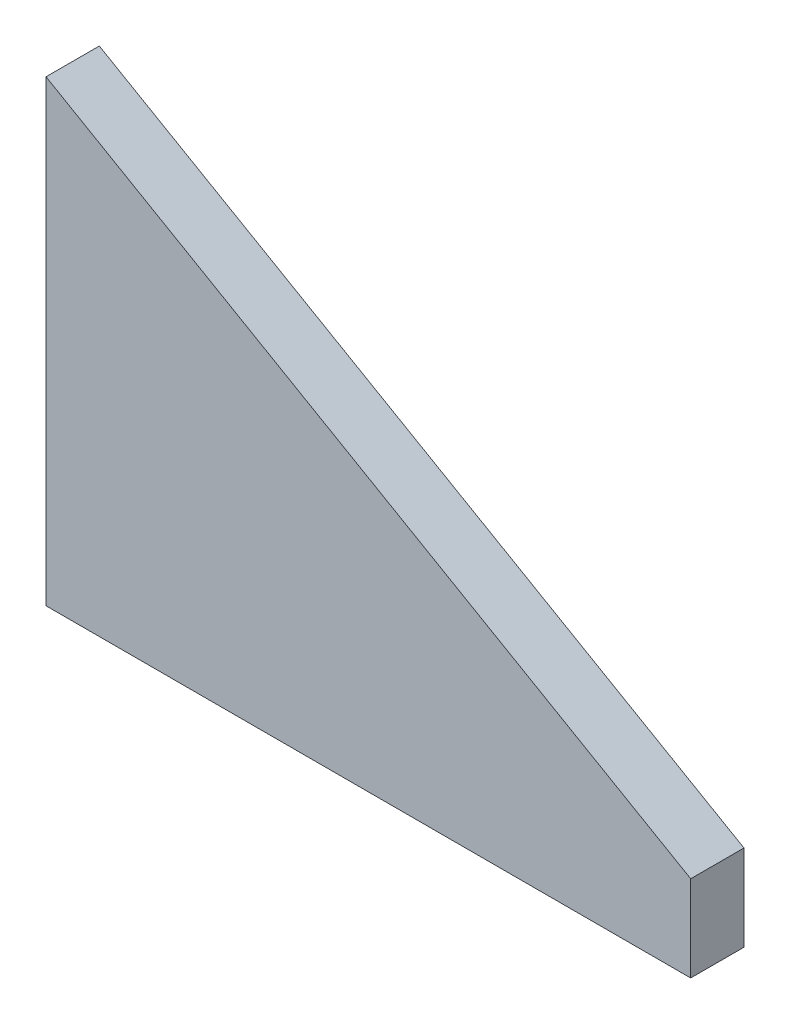
ISO-10303-21;
HEADER;
FILE_DESCRIPTION(('STEP AP214'),'2;1');
FILE_NAME('part.step','',(''),(''),'','','');
FILE_SCHEMA(('AUTOMOTIVE_DESIGN { 1 0 10303 214 1 1 1 1 }'));
ENDSEC;
DATA;
#1=APPLICATION_CONTEXT('core data for automotive mechanical design processes');
#2=APPLICATION_PROTOCOL_DEFINITION('international standard','automotive_design',2000,#1);
#3=PRODUCT_CONTEXT('',#1,'mechanical');
#4=PRODUCT('Part','Part','',(#3));
#5=PRODUCT_RELATED_PRODUCT_CATEGORY('part','',(#4));
#6=PRODUCT_DEFINITION_FORMATION('','',#4);
#7=PRODUCT_DEFINITION_CONTEXT('part definition',#1,'design');
#8=PRODUCT_DEFINITION('design','',#6,#7);
#9=PRODUCT_DEFINITION_SHAPE('','',#8);
#10=(LENGTH_UNIT() NAMED_UNIT(*) SI_UNIT(.MILLI.,.METRE.));
#11=(NAMED_UNIT(*) PLANE_ANGLE_UNIT() SI_UNIT($,.RADIAN.));
#12=(NAMED_UNIT(*) SI_UNIT($,.STERADIAN.) SOLID_ANGLE_UNIT());
#13=UNCERTAINTY_MEASURE_WITH_UNIT(LENGTH_MEASURE(1.E-05),#10,'distance_accuracy_value','');
#14=(GEOMETRIC_REPRESENTATION_CONTEXT(3) GLOBAL_UNCERTAINTY_ASSIGNED_CONTEXT((#13)) GLOBAL_UNIT_ASSIGNED_CONTEXT((#10,
#11,#12)) REPRESENTATION_CONTEXT('',''));
#15=CARTESIAN_POINT('',(0.,0.,0.));
#16=DIRECTION('',(0.,0.,1.));
#17=DIRECTION('',(1.,0.,0.));
#18=AXIS2_PLACEMENT_3D('',#15,#16,#17);
#19=CARTESIAN_POINT('',(-9.525,-9.525,0.787400000000001));
#20=DIRECTION('',(0.,1.,0.));
#21=DIRECTION('',(0.,0.,1.));
#22=AXIS2_PLACEMENT_3D('',#19,#20,#21);
#23=PLANE('',#22);
#24=DIRECTION('',(1.,0.,0.));
#25=VECTOR('',#24,1.);
#26=CARTESIAN_POINT('',(-9.525,-9.525,-0.787399999999994));
#27=LINE('',#26,#25);
#28=CARTESIAN_POINT('',(-9.525,-9.525,-0.787399999999994));
#29=VERTEX_POINT('',#28);
#30=CARTESIAN_POINT('',(9.525,-9.525,-0.787399999999994));
#31=VERTEX_POINT('',#30);
#32=EDGE_CURVE('E86',#29,#31,#27,.T.);
#33=ORIENTED_EDGE('',*,*,#32,.T.);
#34=DIRECTION('',(0.,0.,-1.));
#35=VECTOR('',#34,1.);
#36=CARTESIAN_POINT('',(9.525,-9.525,0.787400000000001));
#37=LINE('',#36,#35);
#38=CARTESIAN_POINT('',(9.525,-9.525,0.787400000000001));
#39=VERTEX_POINT('',#38);
#40=EDGE_CURVE('E40',#39,#31,#37,.T.);
#41=ORIENTED_EDGE('',*,*,#40,.F.);
#42=DIRECTION('',(1.,0.,0.));
#43=VECTOR('',#42,1.);
#44=CARTESIAN_POINT('',(-9.525,-9.525,0.787400000000001));
#45=LINE('',#44,#43);
#46=CARTESIAN_POINT('',(-9.525,-9.525,0.787400000000001));
#47=VERTEX_POINT('',#46);
#48=EDGE_CURVE('E79',#47,#39,#45,.T.);
#49=ORIENTED_EDGE('',*,*,#48,.F.);
#50=DIRECTION('',(0.,0.,-1.));
#51=VECTOR('',#50,1.);
#52=CARTESIAN_POINT('',(-9.525,-9.525,0.787400000000001));
#53=LINE('',#52,#51);
#54=EDGE_CURVE('E11',#47,#29,#53,.T.);
#55=ORIENTED_EDGE('',*,*,#54,.T.);
#56=EDGE_LOOP('',(#33,#41,#49,#55));
#57=FACE_BOUND('',#56,.T.);
#58=ADVANCED_FACE('F32',(#57),#23,.F.);
#59=CARTESIAN_POINT('',(9.525,-9.525,0.787400000000001));
#60=DIRECTION('',(-1.,0.,0.));
#61=DIRECTION('',(0.,0.,1.));
#62=AXIS2_PLACEMENT_3D('',#59,#60,#61);
#63=PLANE('',#62);
#64=DIRECTION('',(0.,1.,0.));
#65=VECTOR('',#64,1.);
#66=CARTESIAN_POINT('',(9.525,-9.525,-0.787399999999994));
#67=LINE('',#66,#65);
#68=CARTESIAN_POINT('',(9.525,-6.985,-0.787399999999994));
#69=VERTEX_POINT('',#68);
#70=EDGE_CURVE('E66',#31,#69,#67,.T.);
#71=ORIENTED_EDGE('',*,*,#70,.T.);
#72=DIRECTION('',(0.,0.,-1.));
#73=VECTOR('',#72,1.);
#74=CARTESIAN_POINT('',(9.525,-6.985,0.787400000000001));
#75=LINE('',#74,#73);
#76=CARTESIAN_POINT('',(9.525,-6.985,0.787400000000001));
#77=VERTEX_POINT('',#76);
#78=EDGE_CURVE('E87',#77,#69,#75,.T.);
#79=ORIENTED_EDGE('',*,*,#78,.F.);
#80=DIRECTION('',(0.,1.,0.));
#81=VECTOR('',#80,1.);
#82=CARTESIAN_POINT('',(9.525,-9.525,0.787400000000001));
#83=LINE('',#82,#81);
#84=EDGE_CURVE('E83',#39,#77,#83,.T.);
#85=ORIENTED_EDGE('',*,*,#84,.F.);
#86=ORIENTED_EDGE('',*,*,#40,.T.);
#87=EDGE_LOOP('',(#71,#79,#85,#86));
#88=FACE_BOUND('',#87,.T.);
#89=ADVANCED_FACE('F88',(#88),#63,.F.);
#90=CARTESIAN_POINT('',(-9.525,4.0132,0.787400000000001));
#91=DIRECTION('',(-0.499988999717658,-0.86603175470726,0.));
#92=DIRECTION('',(0.86603175470726,-0.499988999717658,0.));
#93=AXIS2_PLACEMENT_3D('',#90,#91,#92);
#94=PLANE('',#93);
#95=DIRECTION('',(-0.86603175470726,0.499988999717658,0.));
#96=VECTOR('',#95,1.);
#97=CARTESIAN_POINT('',(-9.525,4.0132,-0.787399999999994));
#98=LINE('',#97,#96);
#99=CARTESIAN_POINT('',(-9.525,4.0132,-0.787399999999994));
#100=VERTEX_POINT('',#99);
#101=EDGE_CURVE('E73',#69,#100,#98,.T.);
#102=ORIENTED_EDGE('',*,*,#101,.T.);
#103=DIRECTION('',(0.,0.,-1.));
#104=VECTOR('',#103,1.);
#105=CARTESIAN_POINT('',(-9.525,4.0132,0.787400000000001));
#106=LINE('',#105,#104);
#107=CARTESIAN_POINT('',(-9.525,4.0132,0.787400000000001));
#108=VERTEX_POINT('',#107);
#109=EDGE_CURVE('E92',#108,#100,#106,.T.);
#110=ORIENTED_EDGE('',*,*,#109,.F.);
#111=DIRECTION('',(-0.86603175470726,0.499988999717658,0.));
#112=VECTOR('',#111,1.);
#113=CARTESIAN_POINT('',(-9.525,4.0132,0.787400000000001));
#114=LINE('',#113,#112);
#115=EDGE_CURVE('E90',#77,#108,#114,.T.);
#116=ORIENTED_EDGE('',*,*,#115,.F.);
#117=ORIENTED_EDGE('',*,*,#78,.T.);
#118=EDGE_LOOP('',(#102,#110,#116,#117));
#119=FACE_BOUND('',#118,.T.);
#120=ADVANCED_FACE('F102',(#119),#94,.F.);
#121=CARTESIAN_POINT('',(-9.525,-6.985,0.787400000000001));
#122=DIRECTION('',(1.,0.,0.));
#123=DIRECTION('',(0.,0.,-1.));
#124=AXIS2_PLACEMENT_3D('',#121,#122,#123);
#125=PLANE('',#124);
#126=DIRECTION('',(0.,-1.,0.));
#127=VECTOR('',#126,1.);
#128=CARTESIAN_POINT('',(-9.525,-6.985,-0.787399999999994));
#129=LINE('',#128,#127);
#130=EDGE_CURVE('E99',#100,#29,#129,.T.);
#131=ORIENTED_EDGE('',*,*,#130,.T.);
#132=ORIENTED_EDGE('',*,*,#54,.F.);
#133=DIRECTION('',(0.,-1.,0.));
#134=VECTOR('',#133,1.);
#135=CARTESIAN_POINT('',(-9.525,-9.525,0.787400000000001));
#136=LINE('',#135,#134);
#137=EDGE_CURVE('E48',#108,#47,#136,.T.);
#138=ORIENTED_EDGE('',*,*,#137,.F.);
#139=ORIENTED_EDGE('',*,*,#109,.T.);
#140=EDGE_LOOP('',(#131,#132,#138,#139));
#141=FACE_BOUND('',#140,.T.);
#142=ADVANCED_FACE('F106',(#141),#125,.F.);
#143=CARTESIAN_POINT('',(-9.525,-9.525,0.787400000000001));
#144=DIRECTION('',(0.,0.,-1.));
#145=DIRECTION('',(-1.,0.,0.));
#146=AXIS2_PLACEMENT_3D('',#143,#144,#145);
#147=PLANE('',#146);
#148=ORIENTED_EDGE('',*,*,#137,.T.);
#149=ORIENTED_EDGE('',*,*,#48,.T.);
#150=ORIENTED_EDGE('',*,*,#84,.T.);
#151=ORIENTED_EDGE('',*,*,#115,.T.);
#152=EDGE_LOOP('',(#148,#149,#150,#151));
#153=FACE_BOUND('',#152,.T.);
#154=ADVANCED_FACE('F81',(#153),#147,.F.);
#155=CARTESIAN_POINT('',(-9.525,-9.525,-0.787399999999994));
#156=DIRECTION('',(0.,0.,-1.));
#157=DIRECTION('',(-1.,0.,0.));
#158=AXIS2_PLACEMENT_3D('',#155,#156,#157);
#159=PLANE('',#158);
#160=ORIENTED_EDGE('',*,*,#32,.F.);
#161=ORIENTED_EDGE('',*,*,#130,.F.);
#162=ORIENTED_EDGE('',*,*,#101,.F.);
#163=ORIENTED_EDGE('',*,*,#70,.F.);
#164=EDGE_LOOP('',(#160,#161,#162,#163));
#165=FACE_BOUND('',#164,.T.);
#166=ADVANCED_FACE('F105',(#165),#159,.T.);
#167=CLOSED_SHELL('',(#58,#89,#120,#142,#154,#166));
#168=MANIFOLD_SOLID_BREP('B2',#167);
#169=ADVANCED_BREP_SHAPE_REPRESENTATION('',(#18,#168),#14);
#170=SHAPE_DEFINITION_REPRESENTATION(#9,#169);
ENDSEC;
END-ISO-10303-21;
